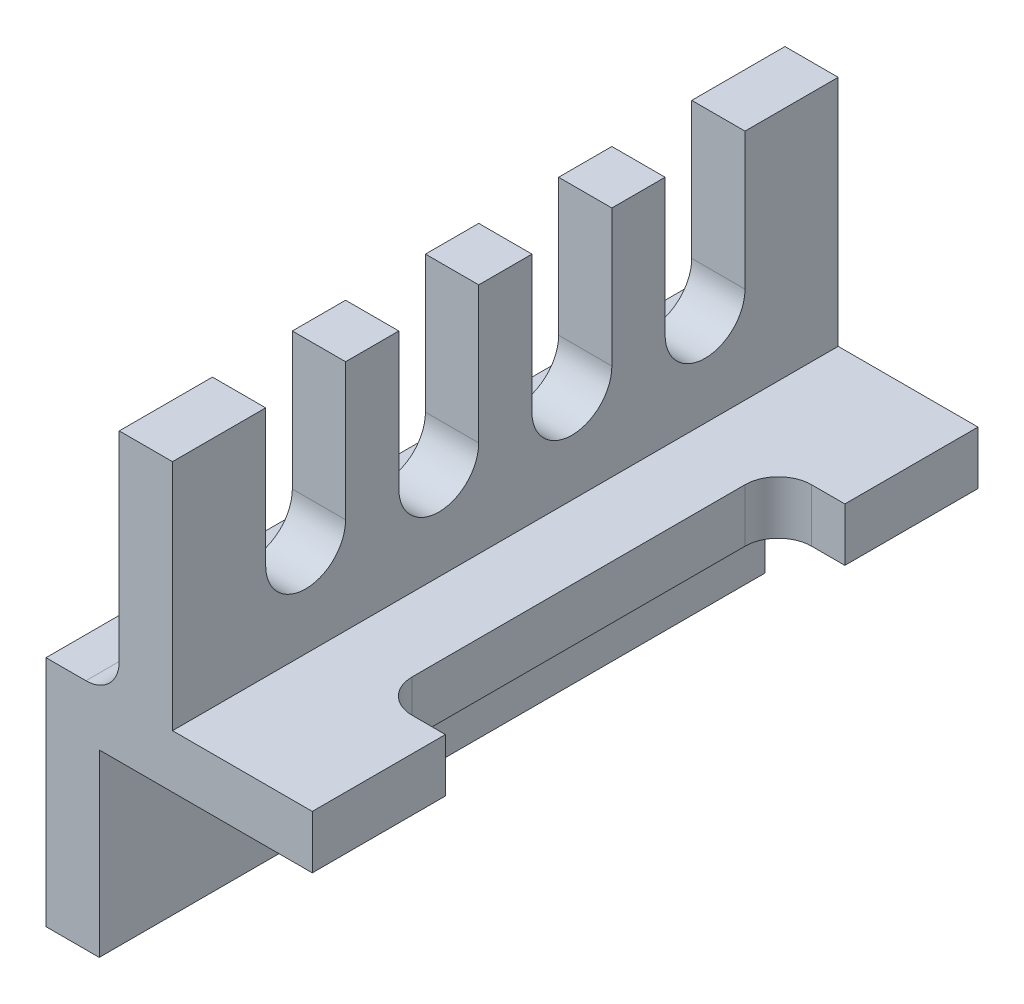
ISO-10303-21;
HEADER;
FILE_DESCRIPTION(('STEP AP214'),'2;1');
FILE_NAME('part.step','',(''),(''),'','','');
FILE_SCHEMA(('AUTOMOTIVE_DESIGN { 1 0 10303 214 1 1 1 1 }'));
ENDSEC;
DATA;
#1=APPLICATION_CONTEXT('core data for automotive mechanical design processes');
#2=APPLICATION_PROTOCOL_DEFINITION('international standard','automotive_design',2000,#1);
#3=PRODUCT_CONTEXT('',#1,'mechanical');
#4=PRODUCT('Part','Part','',(#3));
#5=PRODUCT_RELATED_PRODUCT_CATEGORY('part','',(#4));
#6=PRODUCT_DEFINITION_FORMATION('','',#4);
#7=PRODUCT_DEFINITION_CONTEXT('part definition',#1,'design');
#8=PRODUCT_DEFINITION('design','',#6,#7);
#9=PRODUCT_DEFINITION_SHAPE('','',#8);
#10=(LENGTH_UNIT() NAMED_UNIT(*) SI_UNIT(.MILLI.,.METRE.));
#11=(NAMED_UNIT(*) PLANE_ANGLE_UNIT() SI_UNIT($,.RADIAN.));
#12=(NAMED_UNIT(*) SI_UNIT($,.STERADIAN.) SOLID_ANGLE_UNIT());
#13=UNCERTAINTY_MEASURE_WITH_UNIT(LENGTH_MEASURE(1.E-05),#10,'distance_accuracy_value','');
#14=(GEOMETRIC_REPRESENTATION_CONTEXT(3) GLOBAL_UNCERTAINTY_ASSIGNED_CONTEXT((#13)) GLOBAL_UNIT_ASSIGNED_CONTEXT((#10,
#11,#12)) REPRESENTATION_CONTEXT('',''));
#15=CARTESIAN_POINT('',(0.,0.,0.));
#16=DIRECTION('',(0.,0.,1.));
#17=DIRECTION('',(1.,0.,0.));
#18=AXIS2_PLACEMENT_3D('',#15,#16,#17);
#19=CARTESIAN_POINT('',(19.,35.,100.));
#20=DIRECTION('',(0.,-1.,0.));
#21=DIRECTION('',(0.,0.,-1.));
#22=AXIS2_PLACEMENT_3D('',#19,#20,#21);
#23=PLANE('',#22);
#24=DIRECTION('',(0.,0.,-1.));
#25=VECTOR('',#24,1.);
#26=CARTESIAN_POINT('',(11.,35.,100.));
#27=LINE('',#26,#25);
#28=CARTESIAN_POINT('',(11.,35.,54.));
#29=VERTEX_POINT('',#28);
#30=CARTESIAN_POINT('',(11.,35.,46.));
#31=VERTEX_POINT('',#30);
#32=EDGE_CURVE('E495',#29,#31,#27,.T.);
#33=ORIENTED_EDGE('',*,*,#32,.F.);
#34=DIRECTION('',(1.,0.,0.));
#35=VECTOR('',#34,1.);
#36=CARTESIAN_POINT('',(-18.1449035966976,35.,54.));
#37=LINE('',#36,#35);
#38=CARTESIAN_POINT('',(19.,35.,54.));
#39=VERTEX_POINT('',#38);
#40=EDGE_CURVE('E516',#29,#39,#37,.T.);
#41=ORIENTED_EDGE('',*,*,#40,.T.);
#42=DIRECTION('',(0.,0.,-1.));
#43=VECTOR('',#42,1.);
#44=CARTESIAN_POINT('',(19.,35.,100.));
#45=LINE('',#44,#43);
#46=CARTESIAN_POINT('',(19.,35.,46.));
#47=VERTEX_POINT('',#46);
#48=EDGE_CURVE('E286',#39,#47,#45,.T.);
#49=ORIENTED_EDGE('',*,*,#48,.T.);
#50=DIRECTION('',(1.,0.,0.));
#51=VECTOR('',#50,1.);
#52=CARTESIAN_POINT('',(-18.1449035966976,35.,46.));
#53=LINE('',#52,#51);
#54=EDGE_CURVE('E517',#31,#47,#53,.T.);
#55=ORIENTED_EDGE('',*,*,#54,.F.);
#56=EDGE_LOOP('',(#33,#41,#49,#55));
#57=FACE_BOUND('',#56,.T.);
#58=ADVANCED_FACE('F39',(#57),#23,.F.);
#59=CARTESIAN_POINT('',(11.,35.,34.));
#60=VERTEX_POINT('',#59);
#61=CARTESIAN_POINT('',(11.,35.,26.));
#62=VERTEX_POINT('',#61);
#63=EDGE_CURVE('E497',#60,#62,#27,.T.);
#64=ORIENTED_EDGE('',*,*,#63,.F.);
#65=DIRECTION('',(1.,0.,0.));
#66=VECTOR('',#65,1.);
#67=CARTESIAN_POINT('',(-18.1449035966976,35.,34.));
#68=LINE('',#67,#66);
#69=CARTESIAN_POINT('',(19.,35.,34.));
#70=VERTEX_POINT('',#69);
#71=EDGE_CURVE('E707',#60,#70,#68,.T.);
#72=ORIENTED_EDGE('',*,*,#71,.T.);
#73=CARTESIAN_POINT('',(19.,35.,26.));
#74=VERTEX_POINT('',#73);
#75=EDGE_CURVE('E294',#70,#74,#45,.T.);
#76=ORIENTED_EDGE('',*,*,#75,.T.);
#77=DIRECTION('',(1.,0.,0.));
#78=VECTOR('',#77,1.);
#79=CARTESIAN_POINT('',(-18.1449035966976,35.,26.));
#80=LINE('',#79,#78);
#81=EDGE_CURVE('E556',#62,#74,#80,.T.);
#82=ORIENTED_EDGE('',*,*,#81,.F.);
#83=EDGE_LOOP('',(#64,#72,#76,#82));
#84=FACE_BOUND('',#83,.T.);
#85=ADVANCED_FACE('F667',(#84),#23,.F.);
#86=CARTESIAN_POINT('',(11.,35.,14.));
#87=VERTEX_POINT('',#86);
#88=CARTESIAN_POINT('',(11.,35.,0.));
#89=VERTEX_POINT('',#88);
#90=EDGE_CURVE('E440',#87,#89,#27,.T.);
#91=ORIENTED_EDGE('',*,*,#90,.F.);
#92=DIRECTION('',(1.,0.,0.));
#93=VECTOR('',#92,1.);
#94=CARTESIAN_POINT('',(-18.1449035966976,35.,14.));
#95=LINE('',#94,#93);
#96=CARTESIAN_POINT('',(19.,35.,14.));
#97=VERTEX_POINT('',#96);
#98=EDGE_CURVE('E541',#87,#97,#95,.T.);
#99=ORIENTED_EDGE('',*,*,#98,.T.);
#100=CARTESIAN_POINT('',(19.,35.,0.));
#101=VERTEX_POINT('',#100);
#102=EDGE_CURVE('E292',#97,#101,#45,.T.);
#103=ORIENTED_EDGE('',*,*,#102,.T.);
#104=DIRECTION('',(-1.,0.,0.));
#105=VECTOR('',#104,1.);
#106=CARTESIAN_POINT('',(19.,35.,0.));
#107=LINE('',#106,#105);
#108=EDGE_CURVE('E390',#101,#89,#107,.T.);
#109=ORIENTED_EDGE('',*,*,#108,.T.);
#110=EDGE_LOOP('',(#91,#99,#103,#109));
#111=FACE_BOUND('',#110,.T.);
#112=ADVANCED_FACE('F672',(#111),#23,.F.);
#113=CARTESIAN_POINT('',(19.,35.,74.));
#114=VERTEX_POINT('',#113);
#115=CARTESIAN_POINT('',(19.,35.,66.));
#116=VERTEX_POINT('',#115);
#117=EDGE_CURVE('E274',#114,#116,#45,.T.);
#118=ORIENTED_EDGE('',*,*,#117,.T.);
#119=DIRECTION('',(1.,0.,0.));
#120=VECTOR('',#119,1.);
#121=CARTESIAN_POINT('',(-18.1449035966976,35.,66.));
#122=LINE('',#121,#120);
#123=CARTESIAN_POINT('',(11.,35.,66.));
#124=VERTEX_POINT('',#123);
#125=EDGE_CURVE('E254',#124,#116,#122,.T.);
#126=ORIENTED_EDGE('',*,*,#125,.F.);
#127=CARTESIAN_POINT('',(11.,35.,74.));
#128=VERTEX_POINT('',#127);
#129=EDGE_CURVE('E492',#128,#124,#27,.T.);
#130=ORIENTED_EDGE('',*,*,#129,.F.);
#131=DIRECTION('',(1.,0.,0.));
#132=VECTOR('',#131,1.);
#133=CARTESIAN_POINT('',(-18.1449035966976,35.,74.));
#134=LINE('',#133,#132);
#135=EDGE_CURVE('E283',#128,#114,#134,.T.);
#136=ORIENTED_EDGE('',*,*,#135,.T.);
#137=EDGE_LOOP('',(#118,#126,#130,#136));
#138=FACE_BOUND('',#137,.T.);
#139=ADVANCED_FACE('F282',(#138),#23,.F.);
#140=CARTESIAN_POINT('',(40.,-8.,100.));
#141=DIRECTION('',(-1.,0.,0.));
#142=DIRECTION('',(0.,0.,1.));
#143=AXIS2_PLACEMENT_3D('',#140,#141,#142);
#144=PLANE('',#143);
#145=DIRECTION('',(0.,0.,-1.));
#146=VECTOR('',#145,1.);
#147=CARTESIAN_POINT('',(40.,-8.,100.));
#148=LINE('',#147,#146);
#149=CARTESIAN_POINT('',(40.,-8.,100.));
#150=VERTEX_POINT('',#149);
#151=CARTESIAN_POINT('',(40.,-7.99999999999999,80.));
#152=VERTEX_POINT('',#151);
#153=EDGE_CURVE('E308',#150,#152,#148,.T.);
#154=ORIENTED_EDGE('',*,*,#153,.T.);
#155=DIRECTION('',(0.,1.,0.));
#156=VECTOR('',#155,1.);
#157=CARTESIAN_POINT('',(40.,-68.8276253029822,80.));
#158=LINE('',#157,#156);
#159=CARTESIAN_POINT('',(40.,0.,80.));
#160=VERTEX_POINT('',#159);
#161=EDGE_CURVE('E607',#152,#160,#158,.T.);
#162=ORIENTED_EDGE('',*,*,#161,.T.);
#163=DIRECTION('',(0.,0.,-1.));
#164=VECTOR('',#163,1.);
#165=CARTESIAN_POINT('',(40.,0.,100.));
#166=LINE('',#165,#164);
#167=CARTESIAN_POINT('',(40.,0.,100.));
#168=VERTEX_POINT('',#167);
#169=EDGE_CURVE('E303',#168,#160,#166,.T.);
#170=ORIENTED_EDGE('',*,*,#169,.F.);
#171=DIRECTION('',(0.,1.,0.));
#172=VECTOR('',#171,1.);
#173=CARTESIAN_POINT('',(40.,-8.,100.));
#174=LINE('',#173,#172);
#175=EDGE_CURVE('E424',#150,#168,#174,.T.);
#176=ORIENTED_EDGE('',*,*,#175,.F.);
#177=EDGE_LOOP('',(#154,#162,#170,#176));
#178=FACE_BOUND('',#177,.T.);
#179=ADVANCED_FACE('F643',(#178),#144,.F.);
#180=CARTESIAN_POINT('',(11.,0.,100.));
#181=DIRECTION('',(0.,-1.,0.));
#182=DIRECTION('',(1.,0.,0.));
#183=AXIS2_PLACEMENT_3D('',#180,#181,#182);
#184=PLANE('',#183);
#185=DIRECTION('',(-1.,0.,0.));
#186=VECTOR('',#185,1.);
#187=CARTESIAN_POINT('',(11.,0.,100.));
#188=LINE('',#187,#186);
#189=CARTESIAN_POINT('',(6.,0.,100.));
#190=VERTEX_POINT('',#189);
#191=CARTESIAN_POINT('',(0.,0.,100.));
#192=VERTEX_POINT('',#191);
#193=EDGE_CURVE('E399',#190,#192,#188,.T.);
#194=ORIENTED_EDGE('',*,*,#193,.F.);
#195=DIRECTION('',(0.,0.,-1.));
#196=VECTOR('',#195,1.);
#197=CARTESIAN_POINT('',(6.,0.,0.));
#198=LINE('',#197,#196);
#199=CARTESIAN_POINT('',(6.,0.,0.));
#200=VERTEX_POINT('',#199);
#201=EDGE_CURVE('E328',#190,#200,#198,.T.);
#202=ORIENTED_EDGE('',*,*,#201,.T.);
#203=DIRECTION('',(-1.,0.,0.));
#204=VECTOR('',#203,1.);
#205=CARTESIAN_POINT('',(11.,0.,0.));
#206=LINE('',#205,#204);
#207=CARTESIAN_POINT('',(0.,0.,0.));
#208=VERTEX_POINT('',#207);
#209=EDGE_CURVE('E441',#200,#208,#206,.T.);
#210=ORIENTED_EDGE('',*,*,#209,.T.);
#211=DIRECTION('',(0.,0.,-1.));
#212=VECTOR('',#211,1.);
#213=CARTESIAN_POINT('',(0.,0.,100.));
#214=LINE('',#213,#212);
#215=EDGE_CURVE('E324',#192,#208,#214,.T.);
#216=ORIENTED_EDGE('',*,*,#215,.F.);
#217=EDGE_LOOP('',(#194,#202,#210,#216));
#218=FACE_BOUND('',#217,.T.);
#219=ADVANCED_FACE('F473',(#218),#184,.F.);
#220=CARTESIAN_POINT('',(0.,0.,100.));
#221=DIRECTION('',(1.,0.,0.));
#222=DIRECTION('',(0.,0.,-1.));
#223=AXIS2_PLACEMENT_3D('',#220,#221,#222);
#224=PLANE('',#223);
#225=DIRECTION('',(0.,-1.,0.));
#226=VECTOR('',#225,1.);
#227=CARTESIAN_POINT('',(0.,0.,0.));
#228=LINE('',#227,#226);
#229=CARTESIAN_POINT('',(0.,-35.,0.));
#230=VERTEX_POINT('',#229);
#231=EDGE_CURVE('E444',#208,#230,#228,.T.);
#232=ORIENTED_EDGE('',*,*,#231,.T.);
#233=DIRECTION('',(0.,0.,-1.));
#234=VECTOR('',#233,1.);
#235=CARTESIAN_POINT('',(0.,-35.,100.));
#236=LINE('',#235,#234);
#237=CARTESIAN_POINT('',(0.,-35.,100.));
#238=VERTEX_POINT('',#237);
#239=EDGE_CURVE('E320',#238,#230,#236,.T.);
#240=ORIENTED_EDGE('',*,*,#239,.F.);
#241=DIRECTION('',(0.,-1.,0.));
#242=VECTOR('',#241,1.);
#243=CARTESIAN_POINT('',(0.,0.,100.));
#244=LINE('',#243,#242);
#245=EDGE_CURVE('E404',#192,#238,#244,.T.);
#246=ORIENTED_EDGE('',*,*,#245,.F.);
#247=ORIENTED_EDGE('',*,*,#215,.T.);
#248=EDGE_LOOP('',(#232,#240,#246,#247));
#249=FACE_BOUND('',#248,.T.);
#250=ADVANCED_FACE('F470',(#249),#224,.F.);
#251=CARTESIAN_POINT('',(0.,-35.,100.));
#252=DIRECTION('',(0.,1.,0.));
#253=DIRECTION('',(0.,0.,1.));
#254=AXIS2_PLACEMENT_3D('',#251,#252,#253);
#255=PLANE('',#254);
#256=DIRECTION('',(1.,0.,0.));
#257=VECTOR('',#256,1.);
#258=CARTESIAN_POINT('',(0.,-35.,0.));
#259=LINE('',#258,#257);
#260=CARTESIAN_POINT('',(8.,-35.,0.));
#261=VERTEX_POINT('',#260);
#262=EDGE_CURVE('E447',#230,#261,#259,.T.);
#263=ORIENTED_EDGE('',*,*,#262,.T.);
#264=DIRECTION('',(0.,0.,-1.));
#265=VECTOR('',#264,1.);
#266=CARTESIAN_POINT('',(8.,-35.,100.));
#267=LINE('',#266,#265);
#268=CARTESIAN_POINT('',(8.,-35.,100.));
#269=VERTEX_POINT('',#268);
#270=EDGE_CURVE('E316',#269,#261,#267,.T.);
#271=ORIENTED_EDGE('',*,*,#270,.F.);
#272=DIRECTION('',(1.,0.,0.));
#273=VECTOR('',#272,1.);
#274=CARTESIAN_POINT('',(0.,-35.,100.));
#275=LINE('',#274,#273);
#276=EDGE_CURVE('E410',#238,#269,#275,.T.);
#277=ORIENTED_EDGE('',*,*,#276,.F.);
#278=ORIENTED_EDGE('',*,*,#239,.T.);
#279=EDGE_LOOP('',(#263,#271,#277,#278));
#280=FACE_BOUND('',#279,.T.);
#281=ADVANCED_FACE('F467',(#280),#255,.F.);
#282=CARTESIAN_POINT('',(8.,-35.,100.));
#283=DIRECTION('',(-1.,0.,0.));
#284=DIRECTION('',(0.,-1.,0.));
#285=AXIS2_PLACEMENT_3D('',#282,#283,#284);
#286=PLANE('',#285);
#287=DIRECTION('',(0.,1.,0.));
#288=VECTOR('',#287,1.);
#289=CARTESIAN_POINT('',(8.,-35.,0.));
#290=LINE('',#289,#288);
#291=CARTESIAN_POINT('',(8.,-8.,0.));
#292=VERTEX_POINT('',#291);
#293=EDGE_CURVE('E450',#261,#292,#290,.T.);
#294=ORIENTED_EDGE('',*,*,#293,.T.);
#295=DIRECTION('',(0.,0.,-1.));
#296=VECTOR('',#295,1.);
#297=CARTESIAN_POINT('',(8.,-8.,100.));
#298=LINE('',#297,#296);
#299=CARTESIAN_POINT('',(8.,-8.,100.));
#300=VERTEX_POINT('',#299);
#301=EDGE_CURVE('E312',#300,#292,#298,.T.);
#302=ORIENTED_EDGE('',*,*,#301,.F.);
#303=DIRECTION('',(0.,1.,0.));
#304=VECTOR('',#303,1.);
#305=CARTESIAN_POINT('',(8.,-35.,100.));
#306=LINE('',#305,#304);
#307=EDGE_CURVE('E418',#269,#300,#306,.T.);
#308=ORIENTED_EDGE('',*,*,#307,.F.);
#309=ORIENTED_EDGE('',*,*,#270,.T.);
#310=EDGE_LOOP('',(#294,#302,#308,#309));
#311=FACE_BOUND('',#310,.T.);
#312=ADVANCED_FACE('F462',(#311),#286,.F.);
#313=CARTESIAN_POINT('',(8.,-8.,100.));
#314=DIRECTION('',(0.,1.,0.));
#315=DIRECTION('',(0.,0.,1.));
#316=AXIS2_PLACEMENT_3D('',#313,#314,#315);
#317=PLANE('',#316);
#318=DIRECTION('',(0.,0.,-1.));
#319=VECTOR('',#318,1.);
#320=CARTESIAN_POINT('',(30.,-7.99999999999999,80.));
#321=LINE('',#320,#319);
#322=CARTESIAN_POINT('',(30.,-7.99999999999999,75.));
#323=VERTEX_POINT('',#322);
#324=CARTESIAN_POINT('',(30.,-7.99999999999999,25.));
#325=VERTEX_POINT('',#324);
#326=EDGE_CURVE('E602',#323,#325,#321,.T.);
#327=ORIENTED_EDGE('',*,*,#326,.F.);
#328=CARTESIAN_POINT('',(35.,-7.99999999999999,75.));
#329=DIRECTION('',(0.,1.,0.));
#330=DIRECTION('',(0.,0.,1.));
#331=AXIS2_PLACEMENT_3D('',#328,#329,#330);
#332=CIRCLE('',#331,5.);
#333=CARTESIAN_POINT('',(35.,-7.99999999999999,80.));
#334=VERTEX_POINT('',#333);
#335=EDGE_CURVE('E357',#323,#334,#332,.T.);
#336=ORIENTED_EDGE('',*,*,#335,.T.);
#337=DIRECTION('',(-1.,0.,0.));
#338=VECTOR('',#337,1.);
#339=CARTESIAN_POINT('',(40.,-7.99999999999999,80.));
#340=LINE('',#339,#338);
#341=EDGE_CURVE('E606',#152,#334,#340,.T.);
#342=ORIENTED_EDGE('',*,*,#341,.F.);
#343=ORIENTED_EDGE('',*,*,#153,.F.);
#344=DIRECTION('',(1.,0.,0.));
#345=VECTOR('',#344,1.);
#346=CARTESIAN_POINT('',(8.,-8.,100.));
#347=LINE('',#346,#345);
#348=EDGE_CURVE('E421',#300,#150,#347,.T.);
#349=ORIENTED_EDGE('',*,*,#348,.F.);
#350=ORIENTED_EDGE('',*,*,#301,.T.);
#351=DIRECTION('',(1.,0.,0.));
#352=VECTOR('',#351,1.);
#353=CARTESIAN_POINT('',(8.,-8.,0.));
#354=LINE('',#353,#352);
#355=CARTESIAN_POINT('',(40.,-8.,0.));
#356=VERTEX_POINT('',#355);
#357=EDGE_CURVE('E379',#292,#356,#354,.T.);
#358=ORIENTED_EDGE('',*,*,#357,.T.);
#359=CARTESIAN_POINT('',(40.,-7.99999999999999,20.));
#360=VERTEX_POINT('',#359);
#361=EDGE_CURVE('E307',#360,#356,#148,.T.);
#362=ORIENTED_EDGE('',*,*,#361,.F.);
#363=DIRECTION('',(1.,0.,0.));
#364=VECTOR('',#363,1.);
#365=CARTESIAN_POINT('',(30.,-7.99999999999999,20.));
#366=LINE('',#365,#364);
#367=CARTESIAN_POINT('',(35.,-7.99999999999999,20.));
#368=VERTEX_POINT('',#367);
#369=EDGE_CURVE('E413',#368,#360,#366,.T.);
#370=ORIENTED_EDGE('',*,*,#369,.F.);
#371=CARTESIAN_POINT('',(35.,-7.99999999999999,25.));
#372=DIRECTION('',(0.,1.,0.));
#373=DIRECTION('',(0.,0.,1.));
#374=AXIS2_PLACEMENT_3D('',#371,#372,#373);
#375=CIRCLE('',#374,5.);
#376=EDGE_CURVE('E11',#368,#325,#375,.T.);
#377=ORIENTED_EDGE('',*,*,#376,.T.);
#378=EDGE_LOOP('',(#327,#336,#342,#343,#349,#350,#358,#362,#370,#377));
#379=FACE_BOUND('',#378,.T.);
#380=ADVANCED_FACE('F455',(#379),#317,.F.);
#381=CARTESIAN_POINT('',(40.,0.,20.));
#382=VERTEX_POINT('',#381);
#383=CARTESIAN_POINT('',(40.,0.,0.));
#384=VERTEX_POINT('',#383);
#385=EDGE_CURVE('E302',#382,#384,#166,.T.);
#386=ORIENTED_EDGE('',*,*,#385,.F.);
#387=DIRECTION('',(0.,1.,0.));
#388=VECTOR('',#387,1.);
#389=CARTESIAN_POINT('',(40.,-68.8276253029822,20.));
#390=LINE('',#389,#388);
#391=EDGE_CURVE('E620',#360,#382,#390,.T.);
#392=ORIENTED_EDGE('',*,*,#391,.F.);
#393=ORIENTED_EDGE('',*,*,#361,.T.);
#394=DIRECTION('',(0.,1.,0.));
#395=VECTOR('',#394,1.);
#396=CARTESIAN_POINT('',(40.,-8.,0.));
#397=LINE('',#396,#395);
#398=EDGE_CURVE('E372',#356,#384,#397,.T.);
#399=ORIENTED_EDGE('',*,*,#398,.T.);
#400=EDGE_LOOP('',(#386,#392,#393,#399));
#401=FACE_BOUND('',#400,.T.);
#402=ADVANCED_FACE('F373',(#401),#144,.F.);
#403=CARTESIAN_POINT('',(40.,0.,100.));
#404=DIRECTION('',(0.,-1.,0.));
#405=DIRECTION('',(1.,0.,0.));
#406=AXIS2_PLACEMENT_3D('',#403,#404,#405);
#407=PLANE('',#406);
#408=ORIENTED_EDGE('',*,*,#169,.T.);
#409=DIRECTION('',(1.,0.,0.));
#410=VECTOR('',#409,1.);
#411=CARTESIAN_POINT('',(40.,0.,80.));
#412=LINE('',#411,#410);
#413=CARTESIAN_POINT('',(35.,0.,80.));
#414=VERTEX_POINT('',#413);
#415=EDGE_CURVE('E617',#414,#160,#412,.T.);
#416=ORIENTED_EDGE('',*,*,#415,.F.);
#417=CARTESIAN_POINT('',(35.,0.,75.));
#418=DIRECTION('',(0.,-1.,0.));
#419=DIRECTION('',(1.,0.,0.));
#420=AXIS2_PLACEMENT_3D('',#417,#418,#419);
#421=CIRCLE('',#420,5.);
#422=CARTESIAN_POINT('',(30.,0.,75.));
#423=VERTEX_POINT('',#422);
#424=EDGE_CURVE('E354',#414,#423,#421,.T.);
#425=ORIENTED_EDGE('',*,*,#424,.T.);
#426=DIRECTION('',(0.,0.,1.));
#427=VECTOR('',#426,1.);
#428=CARTESIAN_POINT('',(30.,0.,80.));
#429=LINE('',#428,#427);
#430=CARTESIAN_POINT('',(30.,0.,25.));
#431=VERTEX_POINT('',#430);
#432=EDGE_CURVE('E613',#431,#423,#429,.T.);
#433=ORIENTED_EDGE('',*,*,#432,.F.);
#434=CARTESIAN_POINT('',(35.,0.,25.));
#435=DIRECTION('',(0.,-1.,0.));
#436=DIRECTION('',(1.,0.,0.));
#437=AXIS2_PLACEMENT_3D('',#434,#435,#436);
#438=CIRCLE('',#437,5.);
#439=CARTESIAN_POINT('',(35.,0.,20.));
#440=VERTEX_POINT('',#439);
#441=EDGE_CURVE('E48',#431,#440,#438,.T.);
#442=ORIENTED_EDGE('',*,*,#441,.T.);
#443=DIRECTION('',(-1.,0.,0.));
#444=VECTOR('',#443,1.);
#445=CARTESIAN_POINT('',(30.,0.,20.));
#446=LINE('',#445,#444);
#447=EDGE_CURVE('E368',#382,#440,#446,.T.);
#448=ORIENTED_EDGE('',*,*,#447,.F.);
#449=ORIENTED_EDGE('',*,*,#385,.T.);
#450=DIRECTION('',(-1.,0.,0.));
#451=VECTOR('',#450,1.);
#452=CARTESIAN_POINT('',(40.,0.,0.));
#453=LINE('',#452,#451);
#454=CARTESIAN_POINT('',(19.,0.,0.));
#455=VERTEX_POINT('',#454);
#456=EDGE_CURVE('E367',#384,#455,#453,.T.);
#457=ORIENTED_EDGE('',*,*,#456,.T.);
#458=DIRECTION('',(0.,0.,-1.));
#459=VECTOR('',#458,1.);
#460=CARTESIAN_POINT('',(19.,0.,100.));
#461=LINE('',#460,#459);
#462=CARTESIAN_POINT('',(19.,0.,100.));
#463=VERTEX_POINT('',#462);
#464=EDGE_CURVE('E291',#463,#455,#461,.T.);
#465=ORIENTED_EDGE('',*,*,#464,.F.);
#466=DIRECTION('',(-1.,0.,0.));
#467=VECTOR('',#466,1.);
#468=CARTESIAN_POINT('',(40.,0.,100.));
#469=LINE('',#468,#467);
#470=EDGE_CURVE('E427',#168,#463,#469,.T.);
#471=ORIENTED_EDGE('',*,*,#470,.F.);
#472=EDGE_LOOP('',(#408,#416,#425,#433,#442,#448,#449,#457,#465,#471));
#473=FACE_BOUND('',#472,.T.);
#474=ADVANCED_FACE('F364',(#473),#407,.F.);
#475=CARTESIAN_POINT('',(19.,0.,100.));
#476=DIRECTION('',(-1.,0.,0.));
#477=DIRECTION('',(0.,0.,1.));
#478=AXIS2_PLACEMENT_3D('',#475,#476,#477);
#479=PLANE('',#478);
#480=ORIENTED_EDGE('',*,*,#48,.F.);
#481=DIRECTION('',(0.,1.,0.));
#482=VECTOR('',#481,1.);
#483=CARTESIAN_POINT('',(19.,35.,54.));
#484=LINE('',#483,#482);
#485=CARTESIAN_POINT('',(19.,14.4401542613516,54.));
#486=VERTEX_POINT('',#485);
#487=EDGE_CURVE('E267',#486,#39,#484,.T.);
#488=ORIENTED_EDGE('',*,*,#487,.F.);
#489=CARTESIAN_POINT('',(19.,14.4401542613516,60.));
#490=DIRECTION('',(1.,0.,0.));
#491=DIRECTION('',(0.,0.,1.));
#492=AXIS2_PLACEMENT_3D('',#489,#490,#491);
#493=CIRCLE('',#492,5.99999999999999);
#494=CARTESIAN_POINT('',(19.,14.4401542613516,66.));
#495=VERTEX_POINT('',#494);
#496=EDGE_CURVE('E277',#495,#486,#493,.T.);
#497=ORIENTED_EDGE('',*,*,#496,.F.);
#498=DIRECTION('',(0.,-1.,0.));
#499=VECTOR('',#498,1.);
#500=CARTESIAN_POINT('',(19.,35.,66.));
#501=LINE('',#500,#499);
#502=EDGE_CURVE('E257',#116,#495,#501,.T.);
#503=ORIENTED_EDGE('',*,*,#502,.F.);
#504=ORIENTED_EDGE('',*,*,#117,.F.);
#505=DIRECTION('',(0.,1.,0.));
#506=VECTOR('',#505,1.);
#507=CARTESIAN_POINT('',(19.,35.,74.));
#508=LINE('',#507,#506);
#509=CARTESIAN_POINT('',(19.,14.4401542613516,74.));
#510=VERTEX_POINT('',#509);
#511=EDGE_CURVE('E587',#510,#114,#508,.T.);
#512=ORIENTED_EDGE('',*,*,#511,.F.);
#513=CARTESIAN_POINT('',(19.,14.4401542613516,80.));
#514=DIRECTION('',(1.,0.,0.));
#515=DIRECTION('',(0.,0.,1.));
#516=AXIS2_PLACEMENT_3D('',#513,#514,#515);
#517=CIRCLE('',#516,5.99999999999999);
#518=CARTESIAN_POINT('',(19.,14.4401542613516,86.));
#519=VERTEX_POINT('',#518);
#520=EDGE_CURVE('E583',#519,#510,#517,.T.);
#521=ORIENTED_EDGE('',*,*,#520,.F.);
#522=DIRECTION('',(0.,-1.,0.));
#523=VECTOR('',#522,1.);
#524=CARTESIAN_POINT('',(19.,35.,86.));
#525=LINE('',#524,#523);
#526=CARTESIAN_POINT('',(19.,35.,86.));
#527=VERTEX_POINT('',#526);
#528=EDGE_CURVE('E579',#527,#519,#525,.T.);
#529=ORIENTED_EDGE('',*,*,#528,.F.);
#530=CARTESIAN_POINT('',(19.,35.,100.));
#531=VERTEX_POINT('',#530);
#532=EDGE_CURVE('E285',#531,#527,#45,.T.);
#533=ORIENTED_EDGE('',*,*,#532,.F.);
#534=DIRECTION('',(0.,1.,0.));
#535=VECTOR('',#534,1.);
#536=CARTESIAN_POINT('',(19.,0.,100.));
#537=LINE('',#536,#535);
#538=EDGE_CURVE('E430',#463,#531,#537,.T.);
#539=ORIENTED_EDGE('',*,*,#538,.F.);
#540=ORIENTED_EDGE('',*,*,#464,.T.);
#541=DIRECTION('',(0.,1.,0.));
#542=VECTOR('',#541,1.);
#543=CARTESIAN_POINT('',(19.,0.,0.));
#544=LINE('',#543,#542);
#545=EDGE_CURVE('E386',#455,#101,#544,.T.);
#546=ORIENTED_EDGE('',*,*,#545,.T.);
#547=ORIENTED_EDGE('',*,*,#102,.F.);
#548=DIRECTION('',(0.,1.,0.));
#549=VECTOR('',#548,1.);
#550=CARTESIAN_POINT('',(19.,35.,14.));
#551=LINE('',#550,#549);
#552=CARTESIAN_POINT('',(19.,14.4401542613516,14.));
#553=VERTEX_POINT('',#552);
#554=EDGE_CURVE('E553',#553,#97,#551,.T.);
#555=ORIENTED_EDGE('',*,*,#554,.F.);
#556=CARTESIAN_POINT('',(19.,14.4401542613516,20.));
#557=DIRECTION('',(1.,0.,0.));
#558=DIRECTION('',(0.,0.,1.));
#559=AXIS2_PLACEMENT_3D('',#556,#557,#558);
#560=CIRCLE('',#559,5.99999999999999);
#561=CARTESIAN_POINT('',(19.,14.4401542613516,26.));
#562=VERTEX_POINT('',#561);
#563=EDGE_CURVE('E549',#562,#553,#560,.T.);
#564=ORIENTED_EDGE('',*,*,#563,.F.);
#565=DIRECTION('',(0.,-1.,0.));
#566=VECTOR('',#565,1.);
#567=CARTESIAN_POINT('',(19.,35.,26.));
#568=LINE('',#567,#566);
#569=EDGE_CURVE('E545',#74,#562,#568,.T.);
#570=ORIENTED_EDGE('',*,*,#569,.F.);
#571=ORIENTED_EDGE('',*,*,#75,.F.);
#572=DIRECTION('',(0.,1.,0.));
#573=VECTOR('',#572,1.);
#574=CARTESIAN_POINT('',(19.,35.,34.));
#575=LINE('',#574,#573);
#576=CARTESIAN_POINT('',(19.,14.4401542613516,34.));
#577=VERTEX_POINT('',#576);
#578=EDGE_CURVE('E523',#577,#70,#575,.T.);
#579=ORIENTED_EDGE('',*,*,#578,.F.);
#580=CARTESIAN_POINT('',(19.,14.4401542613516,40.));
#581=DIRECTION('',(1.,0.,0.));
#582=DIRECTION('',(0.,0.,1.));
#583=AXIS2_PLACEMENT_3D('',#580,#581,#582);
#584=CIRCLE('',#583,5.99999999999999);
#585=CARTESIAN_POINT('',(19.,14.4401542613516,46.));
#586=VERTEX_POINT('',#585);
#587=EDGE_CURVE('E529',#586,#577,#584,.T.);
#588=ORIENTED_EDGE('',*,*,#587,.F.);
#589=DIRECTION('',(0.,-1.,0.));
#590=VECTOR('',#589,1.);
#591=CARTESIAN_POINT('',(19.,35.,46.));
#592=LINE('',#591,#590);
#593=EDGE_CURVE('E570',#47,#586,#592,.T.);
#594=ORIENTED_EDGE('',*,*,#593,.F.);
#595=EDGE_LOOP('',(#480,#488,#497,#503,#504,#512,#521,#529,#533,#539,#540,#546,#547,#555,#564,
#570,#571,#579,#588,#594));
#596=FACE_BOUND('',#595,.T.);
#597=ADVANCED_FACE('F272',(#596),#479,.F.);
#598=ORIENTED_EDGE('',*,*,#532,.T.);
#599=DIRECTION('',(1.,0.,0.));
#600=VECTOR('',#599,1.);
#601=CARTESIAN_POINT('',(-18.1449035966976,35.,86.));
#602=LINE('',#601,#600);
#603=CARTESIAN_POINT('',(11.,35.,86.));
#604=VERTEX_POINT('',#603);
#605=EDGE_CURVE('E489',#604,#527,#602,.T.);
#606=ORIENTED_EDGE('',*,*,#605,.F.);
#607=CARTESIAN_POINT('',(11.,35.,100.));
#608=VERTEX_POINT('',#607);
#609=EDGE_CURVE('E297',#608,#604,#27,.T.);
#610=ORIENTED_EDGE('',*,*,#609,.F.);
#611=DIRECTION('',(-1.,0.,0.));
#612=VECTOR('',#611,1.);
#613=CARTESIAN_POINT('',(19.,35.,100.));
#614=LINE('',#613,#612);
#615=EDGE_CURVE('E433',#531,#608,#614,.T.);
#616=ORIENTED_EDGE('',*,*,#615,.F.);
#617=EDGE_LOOP('',(#598,#606,#610,#616));
#618=FACE_BOUND('',#617,.T.);
#619=ADVANCED_FACE('F488',(#618),#23,.F.);
#620=CARTESIAN_POINT('',(11.,35.,100.));
#621=DIRECTION('',(1.,0.,0.));
#622=DIRECTION('',(0.,1.,0.));
#623=AXIS2_PLACEMENT_3D('',#620,#621,#622);
#624=PLANE('',#623);
#625=DIRECTION('',(0.,-1.,0.));
#626=VECTOR('',#625,1.);
#627=CARTESIAN_POINT('',(11.,35.,0.));
#628=LINE('',#627,#626);
#629=CARTESIAN_POINT('',(11.,5.,0.));
#630=VERTEX_POINT('',#629);
#631=EDGE_CURVE('E396',#89,#630,#628,.T.);
#632=ORIENTED_EDGE('',*,*,#631,.T.);
#633=DIRECTION('',(0.,0.,-1.));
#634=VECTOR('',#633,1.);
#635=CARTESIAN_POINT('',(11.,5.,100.));
#636=LINE('',#635,#634);
#637=CARTESIAN_POINT('',(11.,5.,100.));
#638=VERTEX_POINT('',#637);
#639=EDGE_CURVE('E332',#630,#638,#636,.F.);
#640=ORIENTED_EDGE('',*,*,#639,.T.);
#641=DIRECTION('',(0.,-1.,0.));
#642=VECTOR('',#641,1.);
#643=CARTESIAN_POINT('',(11.,35.,100.));
#644=LINE('',#643,#642);
#645=EDGE_CURVE('E436',#608,#638,#644,.T.);
#646=ORIENTED_EDGE('',*,*,#645,.F.);
#647=ORIENTED_EDGE('',*,*,#609,.T.);
#648=DIRECTION('',(0.,1.,0.));
#649=VECTOR('',#648,1.);
#650=CARTESIAN_POINT('',(11.,35.,86.));
#651=LINE('',#650,#649);
#652=CARTESIAN_POINT('',(11.,14.4401542613516,86.));
#653=VERTEX_POINT('',#652);
#654=EDGE_CURVE('E578',#653,#604,#651,.T.);
#655=ORIENTED_EDGE('',*,*,#654,.F.);
#656=CARTESIAN_POINT('',(11.,14.4401542613516,80.));
#657=DIRECTION('',(1.,0.,0.));
#658=DIRECTION('',(0.,1.,0.));
#659=AXIS2_PLACEMENT_3D('',#656,#657,#658);
#660=CIRCLE('',#659,5.99999999999999);
#661=CARTESIAN_POINT('',(11.,14.4401542613516,74.));
#662=VERTEX_POINT('',#661);
#663=EDGE_CURVE('E571',#662,#653,#660,.F.);
#664=ORIENTED_EDGE('',*,*,#663,.F.);
#665=DIRECTION('',(0.,-1.,0.));
#666=VECTOR('',#665,1.);
#667=CARTESIAN_POINT('',(11.,35.,74.));
#668=LINE('',#667,#666);
#669=EDGE_CURVE('E575',#128,#662,#668,.T.);
#670=ORIENTED_EDGE('',*,*,#669,.F.);
#671=ORIENTED_EDGE('',*,*,#129,.T.);
#672=DIRECTION('',(0.,1.,0.));
#673=VECTOR('',#672,1.);
#674=CARTESIAN_POINT('',(11.,35.,66.));
#675=LINE('',#674,#673);
#676=CARTESIAN_POINT('',(11.,14.4401542613516,66.));
#677=VERTEX_POINT('',#676);
#678=EDGE_CURVE('E260',#677,#124,#675,.T.);
#679=ORIENTED_EDGE('',*,*,#678,.F.);
#680=CARTESIAN_POINT('',(11.,14.4401542613516,60.));
#681=DIRECTION('',(1.,0.,0.));
#682=DIRECTION('',(0.,1.,0.));
#683=AXIS2_PLACEMENT_3D('',#680,#681,#682);
#684=CIRCLE('',#683,5.99999999999999);
#685=CARTESIAN_POINT('',(11.,14.4401542613516,54.));
#686=VERTEX_POINT('',#685);
#687=EDGE_CURVE('E734',#686,#677,#684,.F.);
#688=ORIENTED_EDGE('',*,*,#687,.F.);
#689=DIRECTION('',(0.,-1.,0.));
#690=VECTOR('',#689,1.);
#691=CARTESIAN_POINT('',(11.,35.,54.));
#692=LINE('',#691,#690);
#693=EDGE_CURVE('E512',#29,#686,#692,.T.);
#694=ORIENTED_EDGE('',*,*,#693,.F.);
#695=ORIENTED_EDGE('',*,*,#32,.T.);
#696=DIRECTION('',(0.,1.,0.));
#697=VECTOR('',#696,1.);
#698=CARTESIAN_POINT('',(11.,35.,46.));
#699=LINE('',#698,#697);
#700=CARTESIAN_POINT('',(11.,14.4401542613516,46.));
#701=VERTEX_POINT('',#700);
#702=EDGE_CURVE('E279',#701,#31,#699,.T.);
#703=ORIENTED_EDGE('',*,*,#702,.F.);
#704=CARTESIAN_POINT('',(11.,14.4401542613516,40.));
#705=DIRECTION('',(1.,0.,0.));
#706=DIRECTION('',(0.,1.,0.));
#707=AXIS2_PLACEMENT_3D('',#704,#705,#706);
#708=CIRCLE('',#707,5.99999999999999);
#709=CARTESIAN_POINT('',(11.,14.4401542613516,34.));
#710=VERTEX_POINT('',#709);
#711=EDGE_CURVE('E711',#710,#701,#708,.F.);
#712=ORIENTED_EDGE('',*,*,#711,.F.);
#713=DIRECTION('',(0.,-1.,0.));
#714=VECTOR('',#713,1.);
#715=CARTESIAN_POINT('',(11.,35.,34.));
#716=LINE('',#715,#714);
#717=EDGE_CURVE('E535',#60,#710,#716,.T.);
#718=ORIENTED_EDGE('',*,*,#717,.F.);
#719=ORIENTED_EDGE('',*,*,#63,.T.);
#720=DIRECTION('',(0.,1.,0.));
#721=VECTOR('',#720,1.);
#722=CARTESIAN_POINT('',(11.,35.,26.));
#723=LINE('',#722,#721);
#724=CARTESIAN_POINT('',(11.,14.4401542613516,26.));
#725=VERTEX_POINT('',#724);
#726=EDGE_CURVE('E544',#725,#62,#723,.T.);
#727=ORIENTED_EDGE('',*,*,#726,.F.);
#728=CARTESIAN_POINT('',(11.,14.4401542613516,20.));
#729=DIRECTION('',(1.,0.,0.));
#730=DIRECTION('',(0.,1.,0.));
#731=AXIS2_PLACEMENT_3D('',#728,#729,#730);
#732=CIRCLE('',#731,5.99999999999999);
#733=CARTESIAN_POINT('',(11.,14.4401542613516,14.));
#734=VERTEX_POINT('',#733);
#735=EDGE_CURVE('E536',#734,#725,#732,.F.);
#736=ORIENTED_EDGE('',*,*,#735,.F.);
#737=DIRECTION('',(0.,-1.,0.));
#738=VECTOR('',#737,1.);
#739=CARTESIAN_POINT('',(11.,35.,14.));
#740=LINE('',#739,#738);
#741=EDGE_CURVE('E540',#87,#734,#740,.T.);
#742=ORIENTED_EDGE('',*,*,#741,.F.);
#743=ORIENTED_EDGE('',*,*,#90,.T.);
#744=EDGE_LOOP('',(#632,#640,#646,#647,#655,#664,#670,#671,#679,#688,#694,#695,#703,#712,#718,
#719,#727,#736,#742,#743));
#745=FACE_BOUND('',#744,.T.);
#746=ADVANCED_FACE('F479',(#745),#624,.F.);
#747=CARTESIAN_POINT('',(0.,0.,100.));
#748=DIRECTION('',(0.,0.,1.));
#749=DIRECTION('',(1.,0.,0.));
#750=AXIS2_PLACEMENT_3D('',#747,#748,#749);
#751=PLANE('',#750);
#752=ORIENTED_EDGE('',*,*,#645,.T.);
#753=CARTESIAN_POINT('',(6.,5.,100.));
#754=DIRECTION('',(0.,0.,1.));
#755=DIRECTION('',(1.,0.,0.));
#756=AXIS2_PLACEMENT_3D('',#753,#754,#755);
#757=CIRCLE('',#756,5.);
#758=EDGE_CURVE('E351',#638,#190,#757,.F.);
#759=ORIENTED_EDGE('',*,*,#758,.T.);
#760=ORIENTED_EDGE('',*,*,#193,.T.);
#761=ORIENTED_EDGE('',*,*,#245,.T.);
#762=ORIENTED_EDGE('',*,*,#276,.T.);
#763=ORIENTED_EDGE('',*,*,#307,.T.);
#764=ORIENTED_EDGE('',*,*,#348,.T.);
#765=ORIENTED_EDGE('',*,*,#175,.T.);
#766=ORIENTED_EDGE('',*,*,#470,.T.);
#767=ORIENTED_EDGE('',*,*,#538,.T.);
#768=ORIENTED_EDGE('',*,*,#615,.T.);
#769=EDGE_LOOP('',(#752,#759,#760,#761,#762,#763,#764,#765,#766,#767,#768));
#770=FACE_BOUND('',#769,.T.);
#771=ADVANCED_FACE('F481',(#770),#751,.T.);
#772=CARTESIAN_POINT('',(0.,0.,0.));
#773=DIRECTION('',(0.,0.,1.));
#774=DIRECTION('',(1.,0.,0.));
#775=AXIS2_PLACEMENT_3D('',#772,#773,#774);
#776=PLANE('',#775);
#777=ORIENTED_EDGE('',*,*,#209,.F.);
#778=CARTESIAN_POINT('',(6.,5.,0.));
#779=DIRECTION('',(0.,0.,1.));
#780=DIRECTION('',(1.,0.,0.));
#781=AXIS2_PLACEMENT_3D('',#778,#779,#780);
#782=CIRCLE('',#781,5.);
#783=EDGE_CURVE('E348',#200,#630,#782,.T.);
#784=ORIENTED_EDGE('',*,*,#783,.T.);
#785=ORIENTED_EDGE('',*,*,#631,.F.);
#786=ORIENTED_EDGE('',*,*,#108,.F.);
#787=ORIENTED_EDGE('',*,*,#545,.F.);
#788=ORIENTED_EDGE('',*,*,#456,.F.);
#789=ORIENTED_EDGE('',*,*,#398,.F.);
#790=ORIENTED_EDGE('',*,*,#357,.F.);
#791=ORIENTED_EDGE('',*,*,#293,.F.);
#792=ORIENTED_EDGE('',*,*,#262,.F.);
#793=ORIENTED_EDGE('',*,*,#231,.F.);
#794=EDGE_LOOP('',(#777,#784,#785,#786,#787,#788,#789,#790,#791,#792,#793));
#795=FACE_BOUND('',#794,.T.);
#796=ADVANCED_FACE('F383',(#795),#776,.F.);
#797=CARTESIAN_POINT('',(40.,-68.8276253029822,80.));
#798=DIRECTION('',(0.,0.,1.));
#799=DIRECTION('',(1.,0.,0.));
#800=AXIS2_PLACEMENT_3D('',#797,#798,#799);
#801=PLANE('',#800);
#802=ORIENTED_EDGE('',*,*,#341,.T.);
#803=DIRECTION('',(0.,1.,0.));
#804=VECTOR('',#803,1.);
#805=CARTESIAN_POINT('',(35.,0.,80.));
#806=LINE('',#805,#804);
#807=EDGE_CURVE('E335',#334,#414,#806,.T.);
#808=ORIENTED_EDGE('',*,*,#807,.T.);
#809=ORIENTED_EDGE('',*,*,#415,.T.);
#810=ORIENTED_EDGE('',*,*,#161,.F.);
#811=EDGE_LOOP('',(#802,#808,#809,#810));
#812=FACE_BOUND('',#811,.T.);
#813=ADVANCED_FACE('F638',(#812),#801,.F.);
#814=CARTESIAN_POINT('',(30.,-68.8276253029822,80.));
#815=DIRECTION('',(-1.,0.,0.));
#816=DIRECTION('',(0.,-1.,0.));
#817=AXIS2_PLACEMENT_3D('',#814,#815,#816);
#818=PLANE('',#817);
#819=ORIENTED_EDGE('',*,*,#432,.T.);
#820=DIRECTION('',(0.,1.,0.));
#821=VECTOR('',#820,1.);
#822=CARTESIAN_POINT('',(30.,-7.99999999999999,75.));
#823=LINE('',#822,#821);
#824=EDGE_CURVE('E343',#423,#323,#823,.F.);
#825=ORIENTED_EDGE('',*,*,#824,.T.);
#826=ORIENTED_EDGE('',*,*,#326,.T.);
#827=DIRECTION('',(0.,1.,0.));
#828=VECTOR('',#827,1.);
#829=CARTESIAN_POINT('',(30.,0.,25.));
#830=LINE('',#829,#828);
#831=EDGE_CURVE('E339',#325,#431,#830,.T.);
#832=ORIENTED_EDGE('',*,*,#831,.T.);
#833=EDGE_LOOP('',(#819,#825,#826,#832));
#834=FACE_BOUND('',#833,.T.);
#835=ADVANCED_FACE('F630',(#834),#818,.F.);
#836=CARTESIAN_POINT('',(30.,-68.8276253029822,20.));
#837=DIRECTION('',(0.,0.,-1.));
#838=DIRECTION('',(-1.,0.,0.));
#839=AXIS2_PLACEMENT_3D('',#836,#837,#838);
#840=PLANE('',#839);
#841=ORIENTED_EDGE('',*,*,#447,.T.);
#842=DIRECTION('',(0.,1.,0.));
#843=VECTOR('',#842,1.);
#844=CARTESIAN_POINT('',(35.,-7.99999999999999,20.));
#845=LINE('',#844,#843);
#846=EDGE_CURVE('E61',#440,#368,#845,.F.);
#847=ORIENTED_EDGE('',*,*,#846,.T.);
#848=ORIENTED_EDGE('',*,*,#369,.T.);
#849=ORIENTED_EDGE('',*,*,#391,.T.);
#850=EDGE_LOOP('',(#841,#847,#848,#849));
#851=FACE_BOUND('',#850,.T.);
#852=ADVANCED_FACE('F624',(#851),#840,.F.);
#853=CARTESIAN_POINT('',(-18.1449035966976,35.,74.));
#854=DIRECTION('',(0.,0.,-1.));
#855=DIRECTION('',(0.,1.,0.));
#856=AXIS2_PLACEMENT_3D('',#853,#854,#855);
#857=PLANE('',#856);
#858=ORIENTED_EDGE('',*,*,#669,.T.);
#859=DIRECTION('',(1.,0.,0.));
#860=VECTOR('',#859,1.);
#861=CARTESIAN_POINT('',(-18.1449035966976,14.4401542613516,74.));
#862=LINE('',#861,#860);
#863=EDGE_CURVE('E592',#662,#510,#862,.T.);
#864=ORIENTED_EDGE('',*,*,#863,.T.);
#865=ORIENTED_EDGE('',*,*,#511,.T.);
#866=ORIENTED_EDGE('',*,*,#135,.F.);
#867=EDGE_LOOP('',(#858,#864,#865,#866));
#868=FACE_BOUND('',#867,.T.);
#869=ADVANCED_FACE('F656',(#868),#857,.F.);
#870=CARTESIAN_POINT('',(-18.1449035966976,14.4401542613516,80.));
#871=DIRECTION('',(1.,0.,0.));
#872=DIRECTION('',(0.,0.,-1.));
#873=AXIS2_PLACEMENT_3D('',#870,#871,#872);
#874=CYLINDRICAL_SURFACE('',#873,5.99999999999999);
#875=ORIENTED_EDGE('',*,*,#663,.T.);
#876=DIRECTION('',(1.,0.,0.));
#877=VECTOR('',#876,1.);
#878=CARTESIAN_POINT('',(-18.1449035966976,14.4401542613516,86.));
#879=LINE('',#878,#877);
#880=EDGE_CURVE('E595',#653,#519,#879,.T.);
#881=ORIENTED_EDGE('',*,*,#880,.T.);
#882=ORIENTED_EDGE('',*,*,#520,.T.);
#883=ORIENTED_EDGE('',*,*,#863,.F.);
#884=EDGE_LOOP('',(#875,#881,#882,#883));
#885=FACE_BOUND('',#884,.T.);
#886=ADVANCED_FACE('F654',(#885),#874,.F.);
#887=CARTESIAN_POINT('',(-18.1449035966976,35.,86.));
#888=DIRECTION('',(0.,0.,1.));
#889=DIRECTION('',(1.,0.,0.));
#890=AXIS2_PLACEMENT_3D('',#887,#888,#889);
#891=PLANE('',#890);
#892=ORIENTED_EDGE('',*,*,#654,.T.);
#893=ORIENTED_EDGE('',*,*,#605,.T.);
#894=ORIENTED_EDGE('',*,*,#528,.T.);
#895=ORIENTED_EDGE('',*,*,#880,.F.);
#896=EDGE_LOOP('',(#892,#893,#894,#895));
#897=FACE_BOUND('',#896,.T.);
#898=ADVANCED_FACE('F649',(#897),#891,.F.);
#899=CARTESIAN_POINT('',(-18.1449035966976,35.,14.));
#900=DIRECTION('',(0.,0.,-1.));
#901=DIRECTION('',(0.,1.,0.));
#902=AXIS2_PLACEMENT_3D('',#899,#900,#901);
#903=PLANE('',#902);
#904=ORIENTED_EDGE('',*,*,#741,.T.);
#905=DIRECTION('',(1.,0.,0.));
#906=VECTOR('',#905,1.);
#907=CARTESIAN_POINT('',(-18.1449035966976,14.4401542613516,14.));
#908=LINE('',#907,#906);
#909=EDGE_CURVE('E560',#734,#553,#908,.T.);
#910=ORIENTED_EDGE('',*,*,#909,.T.);
#911=ORIENTED_EDGE('',*,*,#554,.T.);
#912=ORIENTED_EDGE('',*,*,#98,.F.);
#913=EDGE_LOOP('',(#904,#910,#911,#912));
#914=FACE_BOUND('',#913,.T.);
#915=ADVANCED_FACE('F695',(#914),#903,.F.);
#916=CARTESIAN_POINT('',(-18.1449035966976,14.4401542613516,20.));
#917=DIRECTION('',(1.,0.,0.));
#918=DIRECTION('',(0.,0.,-1.));
#919=AXIS2_PLACEMENT_3D('',#916,#917,#918);
#920=CYLINDRICAL_SURFACE('',#919,5.99999999999999);
#921=ORIENTED_EDGE('',*,*,#735,.T.);
#922=DIRECTION('',(1.,0.,0.));
#923=VECTOR('',#922,1.);
#924=CARTESIAN_POINT('',(-18.1449035966976,14.4401542613516,26.));
#925=LINE('',#924,#923);
#926=EDGE_CURVE('E563',#725,#562,#925,.T.);
#927=ORIENTED_EDGE('',*,*,#926,.T.);
#928=ORIENTED_EDGE('',*,*,#563,.T.);
#929=ORIENTED_EDGE('',*,*,#909,.F.);
#930=EDGE_LOOP('',(#921,#927,#928,#929));
#931=FACE_BOUND('',#930,.T.);
#932=ADVANCED_FACE('F699',(#931),#920,.F.);
#933=CARTESIAN_POINT('',(-18.1449035966976,35.,26.));
#934=DIRECTION('',(0.,0.,1.));
#935=DIRECTION('',(1.,0.,0.));
#936=AXIS2_PLACEMENT_3D('',#933,#934,#935);
#937=PLANE('',#936);
#938=ORIENTED_EDGE('',*,*,#726,.T.);
#939=ORIENTED_EDGE('',*,*,#81,.T.);
#940=ORIENTED_EDGE('',*,*,#569,.T.);
#941=ORIENTED_EDGE('',*,*,#926,.F.);
#942=EDGE_LOOP('',(#938,#939,#940,#941));
#943=FACE_BOUND('',#942,.T.);
#944=ADVANCED_FACE('F701',(#943),#937,.F.);
#945=CARTESIAN_POINT('',(-18.1449035966976,35.,34.));
#946=DIRECTION('',(0.,0.,-1.));
#947=DIRECTION('',(0.,1.,0.));
#948=AXIS2_PLACEMENT_3D('',#945,#946,#947);
#949=PLANE('',#948);
#950=ORIENTED_EDGE('',*,*,#717,.T.);
#951=DIRECTION('',(1.,0.,0.));
#952=VECTOR('',#951,1.);
#953=CARTESIAN_POINT('',(-18.1449035966976,14.4401542613516,34.));
#954=LINE('',#953,#952);
#955=EDGE_CURVE('E527',#710,#577,#954,.T.);
#956=ORIENTED_EDGE('',*,*,#955,.T.);
#957=ORIENTED_EDGE('',*,*,#578,.T.);
#958=ORIENTED_EDGE('',*,*,#71,.F.);
#959=EDGE_LOOP('',(#950,#956,#957,#958));
#960=FACE_BOUND('',#959,.T.);
#961=ADVANCED_FACE('F753',(#960),#949,.F.);
#962=CARTESIAN_POINT('',(-18.1449035966976,14.4401542613516,40.));
#963=DIRECTION('',(1.,0.,0.));
#964=DIRECTION('',(0.,0.,-1.));
#965=AXIS2_PLACEMENT_3D('',#962,#963,#964);
#966=CYLINDRICAL_SURFACE('',#965,5.99999999999999);
#967=ORIENTED_EDGE('',*,*,#711,.T.);
#968=DIRECTION('',(1.,0.,0.));
#969=VECTOR('',#968,1.);
#970=CARTESIAN_POINT('',(-18.1449035966976,14.4401542613516,46.));
#971=LINE('',#970,#969);
#972=EDGE_CURVE('E522',#701,#586,#971,.T.);
#973=ORIENTED_EDGE('',*,*,#972,.T.);
#974=ORIENTED_EDGE('',*,*,#587,.T.);
#975=ORIENTED_EDGE('',*,*,#955,.F.);
#976=EDGE_LOOP('',(#967,#973,#974,#975));
#977=FACE_BOUND('',#976,.T.);
#978=ADVANCED_FACE('F752',(#977),#966,.F.);
#979=CARTESIAN_POINT('',(-18.1449035966976,35.,46.));
#980=DIRECTION('',(0.,0.,1.));
#981=DIRECTION('',(1.,0.,0.));
#982=AXIS2_PLACEMENT_3D('',#979,#980,#981);
#983=PLANE('',#982);
#984=ORIENTED_EDGE('',*,*,#702,.T.);
#985=ORIENTED_EDGE('',*,*,#54,.T.);
#986=ORIENTED_EDGE('',*,*,#593,.T.);
#987=ORIENTED_EDGE('',*,*,#972,.F.);
#988=EDGE_LOOP('',(#984,#985,#986,#987));
#989=FACE_BOUND('',#988,.T.);
#990=ADVANCED_FACE('F749',(#989),#983,.F.);
#991=CARTESIAN_POINT('',(-18.1449035966976,35.,54.));
#992=DIRECTION('',(0.,0.,-1.));
#993=DIRECTION('',(0.,1.,0.));
#994=AXIS2_PLACEMENT_3D('',#991,#992,#993);
#995=PLANE('',#994);
#996=ORIENTED_EDGE('',*,*,#693,.T.);
#997=DIRECTION('',(1.,0.,0.));
#998=VECTOR('',#997,1.);
#999=CARTESIAN_POINT('',(-18.1449035966976,14.4401542613516,54.));
#1000=LINE('',#999,#998);
#1001=EDGE_CURVE('E729',#686,#486,#1000,.T.);
#1002=ORIENTED_EDGE('',*,*,#1001,.T.);
#1003=ORIENTED_EDGE('',*,*,#487,.T.);
#1004=ORIENTED_EDGE('',*,*,#40,.F.);
#1005=EDGE_LOOP('',(#996,#1002,#1003,#1004));
#1006=FACE_BOUND('',#1005,.T.);
#1007=ADVANCED_FACE('F747',(#1006),#995,.F.);
#1008=CARTESIAN_POINT('',(-18.1449035966976,14.4401542613516,60.));
#1009=DIRECTION('',(1.,0.,0.));
#1010=DIRECTION('',(0.,0.,-1.));
#1011=AXIS2_PLACEMENT_3D('',#1008,#1009,#1010);
#1012=CYLINDRICAL_SURFACE('',#1011,5.99999999999999);
#1013=ORIENTED_EDGE('',*,*,#687,.T.);
#1014=DIRECTION('',(1.,0.,0.));
#1015=VECTOR('',#1014,1.);
#1016=CARTESIAN_POINT('',(-18.1449035966976,14.4401542613516,66.));
#1017=LINE('',#1016,#1015);
#1018=EDGE_CURVE('E266',#677,#495,#1017,.T.);
#1019=ORIENTED_EDGE('',*,*,#1018,.T.);
#1020=ORIENTED_EDGE('',*,*,#496,.T.);
#1021=ORIENTED_EDGE('',*,*,#1001,.F.);
#1022=EDGE_LOOP('',(#1013,#1019,#1020,#1021));
#1023=FACE_BOUND('',#1022,.T.);
#1024=ADVANCED_FACE('F745',(#1023),#1012,.F.);
#1025=CARTESIAN_POINT('',(-18.1449035966976,35.,66.));
#1026=DIRECTION('',(0.,0.,1.));
#1027=DIRECTION('',(1.,0.,0.));
#1028=AXIS2_PLACEMENT_3D('',#1025,#1026,#1027);
#1029=PLANE('',#1028);
#1030=ORIENTED_EDGE('',*,*,#678,.T.);
#1031=ORIENTED_EDGE('',*,*,#125,.T.);
#1032=ORIENTED_EDGE('',*,*,#502,.T.);
#1033=ORIENTED_EDGE('',*,*,#1018,.F.);
#1034=EDGE_LOOP('',(#1030,#1031,#1032,#1033));
#1035=FACE_BOUND('',#1034,.T.);
#1036=ADVANCED_FACE('F256',(#1035),#1029,.F.);
#1037=CARTESIAN_POINT('',(6.,5.,100.));
#1038=DIRECTION('',(0.,0.,1.));
#1039=DIRECTION('',(1.,0.,0.));
#1040=AXIS2_PLACEMENT_3D('',#1037,#1038,#1039);
#1041=CYLINDRICAL_SURFACE('',#1040,5.);
#1042=ORIENTED_EDGE('',*,*,#758,.F.);
#1043=ORIENTED_EDGE('',*,*,#639,.F.);
#1044=ORIENTED_EDGE('',*,*,#783,.F.);
#1045=ORIENTED_EDGE('',*,*,#201,.F.);
#1046=EDGE_LOOP('',(#1042,#1043,#1044,#1045));
#1047=FACE_BOUND('',#1046,.T.);
#1048=ADVANCED_FACE('F477',(#1047),#1041,.F.);
#1049=CARTESIAN_POINT('',(35.,-68.8276253029822,75.));
#1050=DIRECTION('',(0.,-1.,0.));
#1051=DIRECTION('',(1.,0.,0.));
#1052=AXIS2_PLACEMENT_3D('',#1049,#1050,#1051);
#1053=CYLINDRICAL_SURFACE('',#1052,5.);
#1054=ORIENTED_EDGE('',*,*,#335,.F.);
#1055=ORIENTED_EDGE('',*,*,#824,.F.);
#1056=ORIENTED_EDGE('',*,*,#424,.F.);
#1057=ORIENTED_EDGE('',*,*,#807,.F.);
#1058=EDGE_LOOP('',(#1054,#1055,#1056,#1057));
#1059=FACE_BOUND('',#1058,.T.);
#1060=ADVANCED_FACE('F636',(#1059),#1053,.F.);
#1061=CARTESIAN_POINT('',(35.,-68.8276253029822,25.));
#1062=DIRECTION('',(0.,-1.,0.));
#1063=DIRECTION('',(1.,0.,0.));
#1064=AXIS2_PLACEMENT_3D('',#1061,#1062,#1063);
#1065=CYLINDRICAL_SURFACE('',#1064,5.);
#1066=ORIENTED_EDGE('',*,*,#376,.F.);
#1067=ORIENTED_EDGE('',*,*,#846,.F.);
#1068=ORIENTED_EDGE('',*,*,#441,.F.);
#1069=ORIENTED_EDGE('',*,*,#831,.F.);
#1070=EDGE_LOOP('',(#1066,#1067,#1068,#1069));
#1071=FACE_BOUND('',#1070,.T.);
#1072=ADVANCED_FACE('F41',(#1071),#1065,.F.);
#1073=CLOSED_SHELL('',(#58,#85,#112,#139,#179,#219,#250,#281,#312,#380,#402,#474,#597,#619,#746,
#771,#796,#813,#835,#852,#869,#886,#898,#915,#932,#944,#961,#978,#990,#1007,#1024,#1036,#1048,
#1060,#1072));
#1074=MANIFOLD_SOLID_BREP('B2',#1073);
#1075=ADVANCED_BREP_SHAPE_REPRESENTATION('',(#18,#1074),#14);
#1076=SHAPE_DEFINITION_REPRESENTATION(#9,#1075);
ENDSEC;
END-ISO-10303-21;
